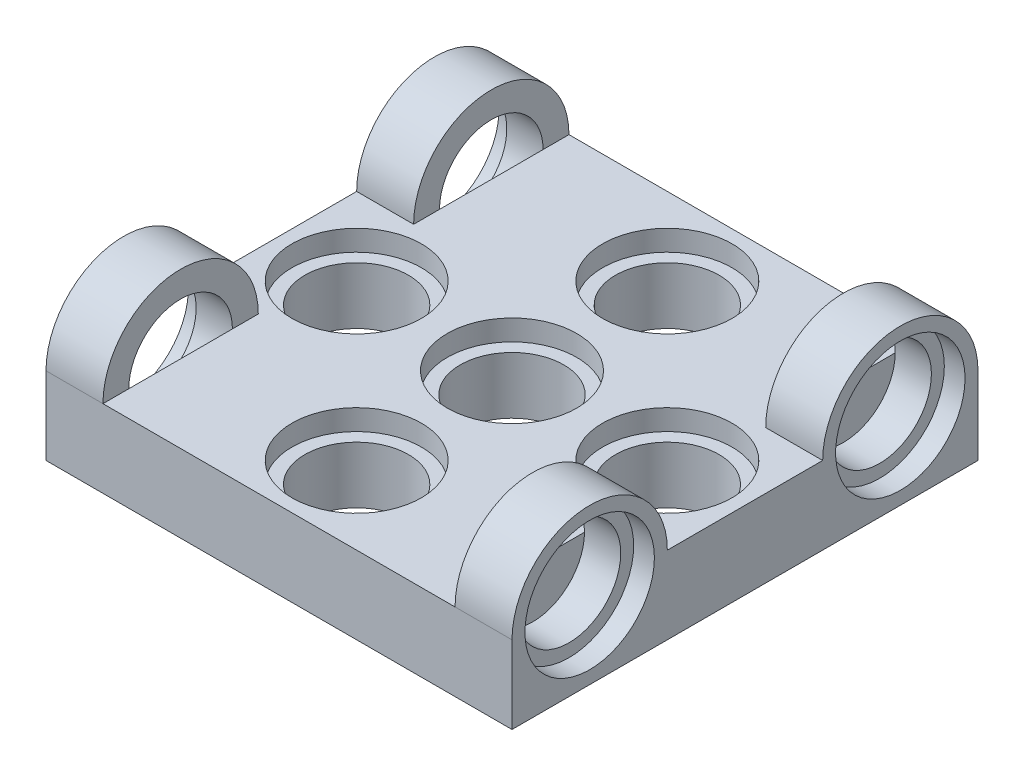
ISO-10303-21;
HEADER;
FILE_DESCRIPTION(('STEP AP214'),'2;1');
FILE_NAME('part.step','',(''),(''),'','','');
FILE_SCHEMA(('AUTOMOTIVE_DESIGN { 1 0 10303 214 1 1 1 1 }'));
ENDSEC;
DATA;
#1=APPLICATION_CONTEXT('core data for automotive mechanical design processes');
#2=APPLICATION_PROTOCOL_DEFINITION('international standard','automotive_design',2000,#1);
#3=PRODUCT_CONTEXT('',#1,'mechanical');
#4=PRODUCT('Part','Part','',(#3));
#5=PRODUCT_RELATED_PRODUCT_CATEGORY('part','',(#4));
#6=PRODUCT_DEFINITION_FORMATION('','',#4);
#7=PRODUCT_DEFINITION_CONTEXT('part definition',#1,'design');
#8=PRODUCT_DEFINITION('design','',#6,#7);
#9=PRODUCT_DEFINITION_SHAPE('','',#8);
#10=(LENGTH_UNIT() NAMED_UNIT(*) SI_UNIT(.MILLI.,.METRE.));
#11=(NAMED_UNIT(*) PLANE_ANGLE_UNIT() SI_UNIT($,.RADIAN.));
#12=(NAMED_UNIT(*) SI_UNIT($,.STERADIAN.) SOLID_ANGLE_UNIT());
#13=UNCERTAINTY_MEASURE_WITH_UNIT(LENGTH_MEASURE(1.E-05),#10,'distance_accuracy_value','');
#14=(GEOMETRIC_REPRESENTATION_CONTEXT(3) GLOBAL_UNCERTAINTY_ASSIGNED_CONTEXT((#13)) GLOBAL_UNIT_ASSIGNED_CONTEXT((#10,
#11,#12)) REPRESENTATION_CONTEXT('',''));
#15=CARTESIAN_POINT('',(0.,0.,0.));
#16=DIRECTION('',(0.,0.,1.));
#17=DIRECTION('',(1.,0.,0.));
#18=AXIS2_PLACEMENT_3D('',#15,#16,#17);
#19=CARTESIAN_POINT('',(18.,-3.,-4.5));
#20=DIRECTION('',(-1.,0.,0.));
#21=DIRECTION('',(0.,0.,1.));
#22=AXIS2_PLACEMENT_3D('',#19,#20,#21);
#23=PLANE('',#22);
#24=CARTESIAN_POINT('',(18.,0.,-1.5));
#25=DIRECTION('',(1.,0.,0.));
#26=DIRECTION('',(0.,0.,-1.));
#27=AXIS2_PLACEMENT_3D('',#24,#25,#26);
#28=CIRCLE('',#27,2.5);
#29=CARTESIAN_POINT('',(18.,0.,-4.));
#30=VERTEX_POINT('',#29);
#31=EDGE_CURVE('E136',#30,#30,#28,.T.);
#32=ORIENTED_EDGE('',*,*,#31,.F.);
#33=EDGE_LOOP('',(#32));
#34=FACE_BOUND('',#33,.T.);
#35=DIRECTION('',(0.,1.,0.));
#36=VECTOR('',#35,1.);
#37=CARTESIAN_POINT('',(18.,-3.,-4.5));
#38=LINE('',#37,#36);
#39=CARTESIAN_POINT('',(18.,-3.,-4.5));
#40=VERTEX_POINT('',#39);
#41=CARTESIAN_POINT('',(18.,0.,-4.5));
#42=VERTEX_POINT('',#41);
#43=EDGE_CURVE('E201',#40,#42,#38,.T.);
#44=ORIENTED_EDGE('',*,*,#43,.T.);
#45=CARTESIAN_POINT('',(18.,0.,-1.5));
#46=DIRECTION('',(1.,0.,0.));
#47=DIRECTION('',(0.,0.,-1.));
#48=AXIS2_PLACEMENT_3D('',#45,#46,#47);
#49=CIRCLE('',#48,3.);
#50=CARTESIAN_POINT('',(18.,0.,1.5));
#51=VERTEX_POINT('',#50);
#52=EDGE_CURVE('E153',#42,#51,#49,.T.);
#53=ORIENTED_EDGE('',*,*,#52,.T.);
#54=DIRECTION('',(0.,0.,1.));
#55=VECTOR('',#54,1.);
#56=CARTESIAN_POINT('',(18.,0.,-4.5));
#57=LINE('',#56,#55);
#58=CARTESIAN_POINT('',(18.,0.,7.5));
#59=VERTEX_POINT('',#58);
#60=EDGE_CURVE('E197',#51,#59,#57,.T.);
#61=ORIENTED_EDGE('',*,*,#60,.T.);
#62=CARTESIAN_POINT('',(18.,0.,10.5));
#63=DIRECTION('',(-1.,0.,0.));
#64=DIRECTION('',(0.,0.,1.));
#65=AXIS2_PLACEMENT_3D('',#62,#63,#64);
#66=CIRCLE('',#65,3.);
#67=CARTESIAN_POINT('',(18.,0.,13.5));
#68=VERTEX_POINT('',#67);
#69=EDGE_CURVE('E166',#68,#59,#66,.T.);
#70=ORIENTED_EDGE('',*,*,#69,.F.);
#71=DIRECTION('',(0.,1.,0.));
#72=VECTOR('',#71,1.);
#73=CARTESIAN_POINT('',(18.,-3.,13.5));
#74=LINE('',#73,#72);
#75=CARTESIAN_POINT('',(18.,-3.,13.5));
#76=VERTEX_POINT('',#75);
#77=EDGE_CURVE('E182',#76,#68,#74,.T.);
#78=ORIENTED_EDGE('',*,*,#77,.F.);
#79=DIRECTION('',(0.,0.,1.));
#80=VECTOR('',#79,1.);
#81=CARTESIAN_POINT('',(18.,-3.,-4.5));
#82=LINE('',#81,#80);
#83=EDGE_CURVE('E198',#40,#76,#82,.T.);
#84=ORIENTED_EDGE('',*,*,#83,.F.);
#85=EDGE_LOOP('',(#44,#53,#61,#70,#78,#84));
#86=FACE_BOUND('',#85,.T.);
#87=CARTESIAN_POINT('',(18.,0.,10.5));
#88=DIRECTION('',(1.,0.,0.));
#89=DIRECTION('',(0.,0.,-1.));
#90=AXIS2_PLACEMENT_3D('',#87,#88,#89);
#91=CIRCLE('',#90,2.5);
#92=CARTESIAN_POINT('',(18.,0.,8.));
#93=VERTEX_POINT('',#92);
#94=EDGE_CURVE('E163',#93,#93,#91,.T.);
#95=ORIENTED_EDGE('',*,*,#94,.F.);
#96=EDGE_LOOP('',(#95));
#97=FACE_BOUND('',#96,.T.);
#98=ADVANCED_FACE('F33',(#34,#86,#97),#23,.F.);
#99=CARTESIAN_POINT('',(0.,0.,0.));
#100=DIRECTION('',(0.,1.,0.));
#101=DIRECTION('',(0.,0.,1.));
#102=AXIS2_PLACEMENT_3D('',#99,#100,#101);
#103=PLANE('',#102);
#104=DIRECTION('',(1.,0.,0.));
#105=VECTOR('',#104,1.);
#106=CARTESIAN_POINT('',(15.8,0.,1.5));
#107=LINE('',#106,#105);
#108=CARTESIAN_POINT('',(15.8,0.,1.5));
#109=VERTEX_POINT('',#108);
#110=EDGE_CURVE('E54',#109,#51,#107,.T.);
#111=ORIENTED_EDGE('',*,*,#110,.F.);
#112=DIRECTION('',(0.,0.,-1.));
#113=VECTOR('',#112,1.);
#114=CARTESIAN_POINT('',(15.8,0.,-4.5));
#115=LINE('',#114,#113);
#116=CARTESIAN_POINT('',(15.8,0.,0.5));
#117=VERTEX_POINT('',#116);
#118=EDGE_CURVE('E148',#109,#117,#115,.T.);
#119=ORIENTED_EDGE('',*,*,#118,.T.);
#120=CARTESIAN_POINT('',(15.8,0.,-3.5));
#121=VERTEX_POINT('',#120);
#122=EDGE_CURVE('E134',#117,#121,#115,.T.);
#123=ORIENTED_EDGE('',*,*,#122,.T.);
#124=CARTESIAN_POINT('',(15.8,0.,-4.5));
#125=VERTEX_POINT('',#124);
#126=EDGE_CURVE('E143',#121,#125,#115,.T.);
#127=ORIENTED_EDGE('',*,*,#126,.T.);
#128=DIRECTION('',(-1.,0.,0.));
#129=VECTOR('',#128,1.);
#130=CARTESIAN_POINT('',(0.,0.,-4.5));
#131=LINE('',#130,#129);
#132=CARTESIAN_POINT('',(2.2,0.,-4.5));
#133=VERTEX_POINT('',#132);
#134=EDGE_CURVE('E325',#125,#133,#131,.T.);
#135=ORIENTED_EDGE('',*,*,#134,.T.);
#136=DIRECTION('',(0.,0.,-1.));
#137=VECTOR('',#136,1.);
#138=CARTESIAN_POINT('',(2.2,0.,-4.5));
#139=LINE('',#138,#137);
#140=CARTESIAN_POINT('',(2.2,0.,-3.5));
#141=VERTEX_POINT('',#140);
#142=EDGE_CURVE('E268',#141,#133,#139,.T.);
#143=ORIENTED_EDGE('',*,*,#142,.F.);
#144=CARTESIAN_POINT('',(2.2,0.,0.5));
#145=VERTEX_POINT('',#144);
#146=EDGE_CURVE('E273',#145,#141,#139,.T.);
#147=ORIENTED_EDGE('',*,*,#146,.F.);
#148=CARTESIAN_POINT('',(2.2,0.,1.5));
#149=VERTEX_POINT('',#148);
#150=EDGE_CURVE('E269',#149,#145,#139,.T.);
#151=ORIENTED_EDGE('',*,*,#150,.F.);
#152=DIRECTION('',(-1.,0.,0.));
#153=VECTOR('',#152,1.);
#154=CARTESIAN_POINT('',(2.2,0.,1.5));
#155=LINE('',#154,#153);
#156=CARTESIAN_POINT('',(0.,0.,1.5));
#157=VERTEX_POINT('',#156);
#158=EDGE_CURVE('E278',#149,#157,#155,.T.);
#159=ORIENTED_EDGE('',*,*,#158,.T.);
#160=DIRECTION('',(0.,0.,1.));
#161=VECTOR('',#160,1.);
#162=CARTESIAN_POINT('',(0.,0.,-4.5));
#163=LINE('',#162,#161);
#164=CARTESIAN_POINT('',(0.,0.,7.5));
#165=VERTEX_POINT('',#164);
#166=EDGE_CURVE('E316',#157,#165,#163,.T.);
#167=ORIENTED_EDGE('',*,*,#166,.T.);
#168=DIRECTION('',(-1.,0.,0.));
#169=VECTOR('',#168,1.);
#170=CARTESIAN_POINT('',(2.2,0.,7.5));
#171=LINE('',#170,#169);
#172=CARTESIAN_POINT('',(2.2,0.,7.5));
#173=VERTEX_POINT('',#172);
#174=EDGE_CURVE('E223',#173,#165,#171,.T.);
#175=ORIENTED_EDGE('',*,*,#174,.F.);
#176=DIRECTION('',(0.,0.,1.));
#177=VECTOR('',#176,1.);
#178=CARTESIAN_POINT('',(2.2,0.,13.5));
#179=LINE('',#178,#177);
#180=CARTESIAN_POINT('',(2.2,0.,8.5));
#181=VERTEX_POINT('',#180);
#182=EDGE_CURVE('E220',#173,#181,#179,.T.);
#183=ORIENTED_EDGE('',*,*,#182,.T.);
#184=CARTESIAN_POINT('',(2.2,0.,12.5));
#185=VERTEX_POINT('',#184);
#186=EDGE_CURVE('E224',#181,#185,#179,.T.);
#187=ORIENTED_EDGE('',*,*,#186,.T.);
#188=CARTESIAN_POINT('',(2.2,0.,13.5));
#189=VERTEX_POINT('',#188);
#190=EDGE_CURVE('E219',#185,#189,#179,.T.);
#191=ORIENTED_EDGE('',*,*,#190,.T.);
#192=DIRECTION('',(-1.,0.,0.));
#193=VECTOR('',#192,1.);
#194=CARTESIAN_POINT('',(0.,0.,13.5));
#195=LINE('',#194,#193);
#196=CARTESIAN_POINT('',(15.8,0.,13.5));
#197=VERTEX_POINT('',#196);
#198=EDGE_CURVE('E243',#197,#189,#195,.T.);
#199=ORIENTED_EDGE('',*,*,#198,.F.);
#200=DIRECTION('',(0.,0.,1.));
#201=VECTOR('',#200,1.);
#202=CARTESIAN_POINT('',(15.8,0.,13.5));
#203=LINE('',#202,#201);
#204=CARTESIAN_POINT('',(15.8,0.,12.5));
#205=VERTEX_POINT('',#204);
#206=EDGE_CURVE('E172',#205,#197,#203,.T.);
#207=ORIENTED_EDGE('',*,*,#206,.F.);
#208=CARTESIAN_POINT('',(15.8,0.,8.5));
#209=VERTEX_POINT('',#208);
#210=EDGE_CURVE('E177',#209,#205,#203,.T.);
#211=ORIENTED_EDGE('',*,*,#210,.F.);
#212=CARTESIAN_POINT('',(15.8,0.,7.5));
#213=VERTEX_POINT('',#212);
#214=EDGE_CURVE('E173',#213,#209,#203,.T.);
#215=ORIENTED_EDGE('',*,*,#214,.F.);
#216=DIRECTION('',(1.,0.,0.));
#217=VECTOR('',#216,1.);
#218=CARTESIAN_POINT('',(15.8,0.,7.5));
#219=LINE('',#218,#217);
#220=EDGE_CURVE('E176',#213,#59,#219,.T.);
#221=ORIENTED_EDGE('',*,*,#220,.T.);
#222=ORIENTED_EDGE('',*,*,#60,.F.);
#223=EDGE_LOOP('',(#111,#119,#123,#127,#135,#143,#147,#151,#159,#167,#175,#183,#187,#191,#199,
#207,#211,#215,#221,#222));
#224=FACE_BOUND('',#223,.T.);
#225=CARTESIAN_POINT('',(9.,0.,4.5));
#226=DIRECTION('',(0.,1.,0.));
#227=DIRECTION('',(0.,0.,1.));
#228=AXIS2_PLACEMENT_3D('',#225,#226,#227);
#229=CIRCLE('',#228,2.5);
#230=CARTESIAN_POINT('',(9.,0.,7.));
#231=VERTEX_POINT('',#230);
#232=EDGE_CURVE('E281',#231,#231,#229,.T.);
#233=ORIENTED_EDGE('',*,*,#232,.F.);
#234=EDGE_LOOP('',(#233));
#235=FACE_BOUND('',#234,.T.);
#236=CARTESIAN_POINT('',(9.,0.,10.5));
#237=DIRECTION('',(0.,1.,0.));
#238=DIRECTION('',(0.,0.,1.));
#239=AXIS2_PLACEMENT_3D('',#236,#237,#238);
#240=CIRCLE('',#239,2.5);
#241=CARTESIAN_POINT('',(9.,0.,13.));
#242=VERTEX_POINT('',#241);
#243=EDGE_CURVE('E231',#242,#242,#240,.T.);
#244=ORIENTED_EDGE('',*,*,#243,.F.);
#245=EDGE_LOOP('',(#244));
#246=FACE_BOUND('',#245,.T.);
#247=CARTESIAN_POINT('',(15.,0.,4.5));
#248=DIRECTION('',(0.,1.,0.));
#249=DIRECTION('',(0.,0.,1.));
#250=AXIS2_PLACEMENT_3D('',#247,#248,#249);
#251=CIRCLE('',#250,2.5);
#252=CARTESIAN_POINT('',(15.,0.,7.));
#253=VERTEX_POINT('',#252);
#254=EDGE_CURVE('E185',#253,#253,#251,.T.);
#255=ORIENTED_EDGE('',*,*,#254,.F.);
#256=EDGE_LOOP('',(#255));
#257=FACE_BOUND('',#256,.T.);
#258=CARTESIAN_POINT('',(9.,0.,-1.5));
#259=DIRECTION('',(0.,1.,0.));
#260=DIRECTION('',(0.,0.,1.));
#261=AXIS2_PLACEMENT_3D('',#258,#259,#260);
#262=CIRCLE('',#261,2.5);
#263=CARTESIAN_POINT('',(9.,0.,1.));
#264=VERTEX_POINT('',#263);
#265=EDGE_CURVE('E294',#264,#264,#262,.T.);
#266=ORIENTED_EDGE('',*,*,#265,.F.);
#267=EDGE_LOOP('',(#266));
#268=FACE_BOUND('',#267,.T.);
#269=CARTESIAN_POINT('',(3.,0.,4.5));
#270=DIRECTION('',(0.,1.,0.));
#271=DIRECTION('',(0.,0.,1.));
#272=AXIS2_PLACEMENT_3D('',#269,#270,#271);
#273=CIRCLE('',#272,2.5);
#274=CARTESIAN_POINT('',(3.,0.,7.));
#275=VERTEX_POINT('',#274);
#276=EDGE_CURVE('E304',#275,#275,#273,.T.);
#277=ORIENTED_EDGE('',*,*,#276,.F.);
#278=EDGE_LOOP('',(#277));
#279=FACE_BOUND('',#278,.T.);
#280=ADVANCED_FACE('F149',(#224,#235,#246,#257,#268,#279),#103,.T.);
#281=CARTESIAN_POINT('',(0.,-3.,-4.5));
#282=DIRECTION('',(-1.,0.,0.));
#283=DIRECTION('',(0.,0.,1.));
#284=AXIS2_PLACEMENT_3D('',#281,#282,#283);
#285=PLANE('',#284);
#286=CARTESIAN_POINT('',(0.,0.,10.5));
#287=DIRECTION('',(-1.,0.,0.));
#288=DIRECTION('',(0.,0.,1.));
#289=AXIS2_PLACEMENT_3D('',#286,#287,#288);
#290=CIRCLE('',#289,2.5);
#291=CARTESIAN_POINT('',(0.,0.,13.));
#292=VERTEX_POINT('',#291);
#293=EDGE_CURVE('E210',#292,#292,#290,.T.);
#294=ORIENTED_EDGE('',*,*,#293,.F.);
#295=EDGE_LOOP('',(#294));
#296=FACE_BOUND('',#295,.T.);
#297=CARTESIAN_POINT('',(0.,0.,-1.5));
#298=DIRECTION('',(-1.,0.,0.));
#299=DIRECTION('',(0.,0.,1.));
#300=AXIS2_PLACEMENT_3D('',#297,#298,#299);
#301=CIRCLE('',#300,2.5);
#302=CARTESIAN_POINT('',(0.,0.,1.));
#303=VERTEX_POINT('',#302);
#304=EDGE_CURVE('E258',#303,#303,#301,.T.);
#305=ORIENTED_EDGE('',*,*,#304,.F.);
#306=EDGE_LOOP('',(#305));
#307=FACE_BOUND('',#306,.T.);
#308=ORIENTED_EDGE('',*,*,#166,.F.);
#309=CARTESIAN_POINT('',(0.,0.,-1.5));
#310=DIRECTION('',(1.,0.,0.));
#311=DIRECTION('',(0.,0.,-1.));
#312=AXIS2_PLACEMENT_3D('',#309,#310,#311);
#313=CIRCLE('',#312,3.);
#314=CARTESIAN_POINT('',(0.,0.,-4.5));
#315=VERTEX_POINT('',#314);
#316=EDGE_CURVE('E261',#315,#157,#313,.T.);
#317=ORIENTED_EDGE('',*,*,#316,.F.);
#318=DIRECTION('',(0.,1.,0.));
#319=VECTOR('',#318,1.);
#320=CARTESIAN_POINT('',(0.,-3.,-4.5));
#321=LINE('',#320,#319);
#322=CARTESIAN_POINT('',(0.,-3.,-4.5));
#323=VERTEX_POINT('',#322);
#324=EDGE_CURVE('E298',#323,#315,#321,.T.);
#325=ORIENTED_EDGE('',*,*,#324,.F.);
#326=DIRECTION('',(0.,0.,1.));
#327=VECTOR('',#326,1.);
#328=CARTESIAN_POINT('',(0.,-3.,-4.5));
#329=LINE('',#328,#327);
#330=CARTESIAN_POINT('',(0.,-3.,13.5));
#331=VERTEX_POINT('',#330);
#332=EDGE_CURVE('E317',#323,#331,#329,.T.);
#333=ORIENTED_EDGE('',*,*,#332,.T.);
#334=DIRECTION('',(0.,1.,0.));
#335=VECTOR('',#334,1.);
#336=CARTESIAN_POINT('',(0.,-3.,13.5));
#337=LINE('',#336,#335);
#338=CARTESIAN_POINT('',(0.,0.,13.5));
#339=VERTEX_POINT('',#338);
#340=EDGE_CURVE('E247',#331,#339,#337,.T.);
#341=ORIENTED_EDGE('',*,*,#340,.T.);
#342=CARTESIAN_POINT('',(0.,0.,10.5));
#343=DIRECTION('',(-1.,0.,0.));
#344=DIRECTION('',(0.,0.,1.));
#345=AXIS2_PLACEMENT_3D('',#342,#343,#344);
#346=CIRCLE('',#345,3.);
#347=EDGE_CURVE('E213',#339,#165,#346,.T.);
#348=ORIENTED_EDGE('',*,*,#347,.T.);
#349=EDGE_LOOP('',(#308,#317,#325,#333,#341,#348));
#350=FACE_BOUND('',#349,.T.);
#351=ADVANCED_FACE('F35',(#296,#307,#350),#285,.T.);
#352=CARTESIAN_POINT('',(0.,-3.,-4.5));
#353=DIRECTION('',(0.,0.,-1.));
#354=DIRECTION('',(-1.,0.,0.));
#355=AXIS2_PLACEMENT_3D('',#352,#353,#354);
#356=PLANE('',#355);
#357=EDGE_CURVE('E320',#42,#125,#131,.T.);
#358=ORIENTED_EDGE('',*,*,#357,.F.);
#359=ORIENTED_EDGE('',*,*,#43,.F.);
#360=DIRECTION('',(-1.,0.,0.));
#361=VECTOR('',#360,1.);
#362=CARTESIAN_POINT('',(0.,-3.,-4.5));
#363=LINE('',#362,#361);
#364=EDGE_CURVE('E319',#40,#323,#363,.T.);
#365=ORIENTED_EDGE('',*,*,#364,.T.);
#366=ORIENTED_EDGE('',*,*,#324,.T.);
#367=DIRECTION('',(-1.,0.,0.));
#368=VECTOR('',#367,1.);
#369=CARTESIAN_POINT('',(2.2,0.,-4.5));
#370=LINE('',#369,#368);
#371=EDGE_CURVE('E272',#133,#315,#370,.T.);
#372=ORIENTED_EDGE('',*,*,#371,.F.);
#373=ORIENTED_EDGE('',*,*,#134,.F.);
#374=EDGE_LOOP('',(#358,#359,#365,#366,#372,#373));
#375=FACE_BOUND('',#374,.T.);
#376=ADVANCED_FACE('F362',(#375),#356,.T.);
#377=CARTESIAN_POINT('',(0.,-3.,0.));
#378=DIRECTION('',(0.,1.,0.));
#379=DIRECTION('',(0.,0.,1.));
#380=AXIS2_PLACEMENT_3D('',#377,#378,#379);
#381=PLANE('',#380);
#382=ORIENTED_EDGE('',*,*,#83,.T.);
#383=DIRECTION('',(-1.,0.,0.));
#384=VECTOR('',#383,1.);
#385=CARTESIAN_POINT('',(0.,-3.,13.5));
#386=LINE('',#385,#384);
#387=EDGE_CURVE('E244',#76,#331,#386,.T.);
#388=ORIENTED_EDGE('',*,*,#387,.T.);
#389=ORIENTED_EDGE('',*,*,#332,.F.);
#390=ORIENTED_EDGE('',*,*,#364,.F.);
#391=EDGE_LOOP('',(#382,#388,#389,#390));
#392=FACE_BOUND('',#391,.T.);
#393=CARTESIAN_POINT('',(9.,-3.,4.5));
#394=DIRECTION('',(0.,1.,0.));
#395=DIRECTION('',(0.,0.,1.));
#396=AXIS2_PLACEMENT_3D('',#393,#394,#395);
#397=CIRCLE('',#396,2.);
#398=CARTESIAN_POINT('',(9.,-3.,6.5));
#399=VERTEX_POINT('',#398);
#400=EDGE_CURVE('E290',#399,#399,#397,.T.);
#401=ORIENTED_EDGE('',*,*,#400,.T.);
#402=EDGE_LOOP('',(#401));
#403=FACE_BOUND('',#402,.T.);
#404=CARTESIAN_POINT('',(9.,-3.,10.5));
#405=DIRECTION('',(0.,1.,0.));
#406=DIRECTION('',(0.,0.,1.));
#407=AXIS2_PLACEMENT_3D('',#404,#405,#406);
#408=CIRCLE('',#407,2.);
#409=CARTESIAN_POINT('',(9.,-3.,12.5));
#410=VERTEX_POINT('',#409);
#411=EDGE_CURVE('E240',#410,#410,#408,.T.);
#412=ORIENTED_EDGE('',*,*,#411,.T.);
#413=EDGE_LOOP('',(#412));
#414=FACE_BOUND('',#413,.T.);
#415=CARTESIAN_POINT('',(9.,-3.,-1.5));
#416=DIRECTION('',(0.,1.,0.));
#417=DIRECTION('',(0.,0.,1.));
#418=AXIS2_PLACEMENT_3D('',#415,#416,#417);
#419=CIRCLE('',#418,2.00000000000001);
#420=CARTESIAN_POINT('',(9.,-3.,0.500000000000006));
#421=VERTEX_POINT('',#420);
#422=EDGE_CURVE('E297',#421,#421,#419,.T.);
#423=ORIENTED_EDGE('',*,*,#422,.T.);
#424=EDGE_LOOP('',(#423));
#425=FACE_BOUND('',#424,.T.);
#426=CARTESIAN_POINT('',(3.,-3.,4.5));
#427=DIRECTION('',(0.,1.,0.));
#428=DIRECTION('',(0.,0.,1.));
#429=AXIS2_PLACEMENT_3D('',#426,#427,#428);
#430=CIRCLE('',#429,2.);
#431=CARTESIAN_POINT('',(3.,-3.,6.5));
#432=VERTEX_POINT('',#431);
#433=EDGE_CURVE('E313',#432,#432,#430,.T.);
#434=ORIENTED_EDGE('',*,*,#433,.T.);
#435=EDGE_LOOP('',(#434));
#436=FACE_BOUND('',#435,.T.);
#437=CARTESIAN_POINT('',(15.,-3.,4.5));
#438=DIRECTION('',(0.,1.,0.));
#439=DIRECTION('',(0.,0.,1.));
#440=AXIS2_PLACEMENT_3D('',#437,#438,#439);
#441=CIRCLE('',#440,2.);
#442=CARTESIAN_POINT('',(15.,-3.,6.5));
#443=VERTEX_POINT('',#442);
#444=EDGE_CURVE('E194',#443,#443,#441,.T.);
#445=ORIENTED_EDGE('',*,*,#444,.T.);
#446=EDGE_LOOP('',(#445));
#447=FACE_BOUND('',#446,.T.);
#448=ADVANCED_FACE('F499',(#392,#403,#414,#425,#436,#447),#381,.F.);
#449=CARTESIAN_POINT('',(3.,0.,4.5));
#450=DIRECTION('',(0.,1.,0.));
#451=DIRECTION('',(0.,0.,1.));
#452=AXIS2_PLACEMENT_3D('',#449,#450,#451);
#453=CYLINDRICAL_SURFACE('',#452,2.00000000000001);
#454=CARTESIAN_POINT('',(3.,-0.799999999999995,4.5));
#455=DIRECTION('',(0.,1.,0.));
#456=DIRECTION('',(0.,0.,1.));
#457=AXIS2_PLACEMENT_3D('',#454,#455,#456);
#458=CIRCLE('',#457,2.00000000000001);
#459=CARTESIAN_POINT('',(3.,-0.799999999999995,6.50000000000001));
#460=VERTEX_POINT('',#459);
#461=EDGE_CURVE('E310',#460,#460,#458,.T.);
#462=ORIENTED_EDGE('',*,*,#461,.T.);
#463=EDGE_LOOP('',(#462));
#464=FACE_BOUND('',#463,.T.);
#465=ORIENTED_EDGE('',*,*,#433,.F.);
#466=EDGE_LOOP('',(#465));
#467=FACE_BOUND('',#466,.T.);
#468=ADVANCED_FACE('F495',(#464,#467),#453,.F.);
#469=CARTESIAN_POINT('',(5.00000000000001,-0.799999999999997,4.5));
#470=DIRECTION('',(0.,-1.,0.));
#471=DIRECTION('',(0.,0.,-1.));
#472=AXIS2_PLACEMENT_3D('',#469,#470,#471);
#473=PLANE('',#472);
#474=ORIENTED_EDGE('',*,*,#461,.F.);
#475=EDGE_LOOP('',(#474));
#476=FACE_BOUND('',#475,.T.);
#477=CARTESIAN_POINT('',(3.,-0.799999999999999,4.5));
#478=DIRECTION('',(0.,1.,0.));
#479=DIRECTION('',(0.,0.,1.));
#480=AXIS2_PLACEMENT_3D('',#477,#478,#479);
#481=CIRCLE('',#480,2.5);
#482=CARTESIAN_POINT('',(3.,-0.799999999999999,7.));
#483=VERTEX_POINT('',#482);
#484=EDGE_CURVE('E307',#483,#483,#481,.T.);
#485=ORIENTED_EDGE('',*,*,#484,.T.);
#486=EDGE_LOOP('',(#485));
#487=FACE_BOUND('',#486,.T.);
#488=ADVANCED_FACE('F491',(#476,#487),#473,.F.);
#489=CARTESIAN_POINT('',(3.,0.,4.5));
#490=DIRECTION('',(0.,1.,0.));
#491=DIRECTION('',(0.,0.,1.));
#492=AXIS2_PLACEMENT_3D('',#489,#490,#491);
#493=CYLINDRICAL_SURFACE('',#492,2.5);
#494=ORIENTED_EDGE('',*,*,#276,.T.);
#495=EDGE_LOOP('',(#494));
#496=FACE_BOUND('',#495,.T.);
#497=ORIENTED_EDGE('',*,*,#484,.F.);
#498=EDGE_LOOP('',(#497));
#499=FACE_BOUND('',#498,.T.);
#500=ADVANCED_FACE('F487',(#496,#499),#493,.F.);
#501=CARTESIAN_POINT('',(9.,0.,-1.5));
#502=DIRECTION('',(0.,1.,0.));
#503=DIRECTION('',(0.,0.,1.));
#504=AXIS2_PLACEMENT_3D('',#501,#502,#503);
#505=CYLINDRICAL_SURFACE('',#504,2.00000000000001);
#506=CARTESIAN_POINT('',(9.,-0.799999999999995,-1.5));
#507=DIRECTION('',(0.,1.,0.));
#508=DIRECTION('',(0.,0.,1.));
#509=AXIS2_PLACEMENT_3D('',#506,#507,#508);
#510=CIRCLE('',#509,2.00000000000001);
#511=CARTESIAN_POINT('',(9.,-0.799999999999995,0.500000000000012));
#512=VERTEX_POINT('',#511);
#513=EDGE_CURVE('E301',#512,#512,#510,.T.);
#514=ORIENTED_EDGE('',*,*,#513,.T.);
#515=EDGE_LOOP('',(#514));
#516=FACE_BOUND('',#515,.T.);
#517=ORIENTED_EDGE('',*,*,#422,.F.);
#518=EDGE_LOOP('',(#517));
#519=FACE_BOUND('',#518,.T.);
#520=ADVANCED_FACE('F483',(#516,#519),#505,.F.);
#521=CARTESIAN_POINT('',(11.,-0.799999999999997,-1.5));
#522=DIRECTION('',(0.,-1.,0.));
#523=DIRECTION('',(0.,0.,-1.));
#524=AXIS2_PLACEMENT_3D('',#521,#522,#523);
#525=PLANE('',#524);
#526=ORIENTED_EDGE('',*,*,#513,.F.);
#527=EDGE_LOOP('',(#526));
#528=FACE_BOUND('',#527,.T.);
#529=CARTESIAN_POINT('',(9.,-0.799999999999999,-1.5));
#530=DIRECTION('',(0.,1.,0.));
#531=DIRECTION('',(0.,0.,1.));
#532=AXIS2_PLACEMENT_3D('',#529,#530,#531);
#533=CIRCLE('',#532,2.5);
#534=CARTESIAN_POINT('',(9.,-0.799999999999999,1.));
#535=VERTEX_POINT('',#534);
#536=EDGE_CURVE('E293',#535,#535,#533,.T.);
#537=ORIENTED_EDGE('',*,*,#536,.T.);
#538=EDGE_LOOP('',(#537));
#539=FACE_BOUND('',#538,.T.);
#540=ADVANCED_FACE('F479',(#528,#539),#525,.F.);
#541=CARTESIAN_POINT('',(9.,0.,-1.5));
#542=DIRECTION('',(0.,1.,0.));
#543=DIRECTION('',(0.,0.,1.));
#544=AXIS2_PLACEMENT_3D('',#541,#542,#543);
#545=CYLINDRICAL_SURFACE('',#544,2.5);
#546=ORIENTED_EDGE('',*,*,#265,.T.);
#547=EDGE_LOOP('',(#546));
#548=FACE_BOUND('',#547,.T.);
#549=ORIENTED_EDGE('',*,*,#536,.F.);
#550=EDGE_LOOP('',(#549));
#551=FACE_BOUND('',#550,.T.);
#552=ADVANCED_FACE('F475',(#548,#551),#545,.F.);
#553=CARTESIAN_POINT('',(9.,0.,4.5));
#554=DIRECTION('',(0.,1.,0.));
#555=DIRECTION('',(0.,0.,1.));
#556=AXIS2_PLACEMENT_3D('',#553,#554,#555);
#557=CYLINDRICAL_SURFACE('',#556,2.00000000000001);
#558=CARTESIAN_POINT('',(9.,-0.799999999999995,4.5));
#559=DIRECTION('',(0.,1.,0.));
#560=DIRECTION('',(0.,0.,1.));
#561=AXIS2_PLACEMENT_3D('',#558,#559,#560);
#562=CIRCLE('',#561,2.00000000000001);
#563=CARTESIAN_POINT('',(9.,-0.799999999999995,6.50000000000001));
#564=VERTEX_POINT('',#563);
#565=EDGE_CURVE('E287',#564,#564,#562,.T.);
#566=ORIENTED_EDGE('',*,*,#565,.T.);
#567=EDGE_LOOP('',(#566));
#568=FACE_BOUND('',#567,.T.);
#569=ORIENTED_EDGE('',*,*,#400,.F.);
#570=EDGE_LOOP('',(#569));
#571=FACE_BOUND('',#570,.T.);
#572=ADVANCED_FACE('F471',(#568,#571),#557,.F.);
#573=CARTESIAN_POINT('',(11.,-0.799999999999997,4.5));
#574=DIRECTION('',(0.,-1.,0.));
#575=DIRECTION('',(0.,0.,-1.));
#576=AXIS2_PLACEMENT_3D('',#573,#574,#575);
#577=PLANE('',#576);
#578=CARTESIAN_POINT('',(9.,-0.799999999999999,4.5));
#579=DIRECTION('',(0.,1.,0.));
#580=DIRECTION('',(0.,0.,1.));
#581=AXIS2_PLACEMENT_3D('',#578,#579,#580);
#582=CIRCLE('',#581,2.5);
#583=CARTESIAN_POINT('',(9.,-0.799999999999999,7.));
#584=VERTEX_POINT('',#583);
#585=EDGE_CURVE('E284',#584,#584,#582,.T.);
#586=ORIENTED_EDGE('',*,*,#585,.T.);
#587=EDGE_LOOP('',(#586));
#588=FACE_BOUND('',#587,.T.);
#589=ORIENTED_EDGE('',*,*,#565,.F.);
#590=EDGE_LOOP('',(#589));
#591=FACE_BOUND('',#590,.T.);
#592=ADVANCED_FACE('F467',(#588,#591),#577,.F.);
#593=CARTESIAN_POINT('',(9.,0.,4.5));
#594=DIRECTION('',(0.,1.,0.));
#595=DIRECTION('',(0.,0.,1.));
#596=AXIS2_PLACEMENT_3D('',#593,#594,#595);
#597=CYLINDRICAL_SURFACE('',#596,2.5);
#598=ORIENTED_EDGE('',*,*,#585,.F.);
#599=EDGE_LOOP('',(#598));
#600=FACE_BOUND('',#599,.T.);
#601=ORIENTED_EDGE('',*,*,#232,.T.);
#602=EDGE_LOOP('',(#601));
#603=FACE_BOUND('',#602,.T.);
#604=ADVANCED_FACE('F464',(#600,#603),#597,.F.);
#605=CARTESIAN_POINT('',(2.2,0.,-1.5));
#606=DIRECTION('',(-1.,0.,0.));
#607=DIRECTION('',(0.,0.,1.));
#608=AXIS2_PLACEMENT_3D('',#605,#606,#607);
#609=CYLINDRICAL_SURFACE('',#608,3.);
#610=ORIENTED_EDGE('',*,*,#316,.T.);
#611=ORIENTED_EDGE('',*,*,#158,.F.);
#612=CARTESIAN_POINT('',(2.2,0.,-1.5));
#613=DIRECTION('',(1.,0.,0.));
#614=DIRECTION('',(0.,0.,-1.));
#615=AXIS2_PLACEMENT_3D('',#612,#613,#614);
#616=CIRCLE('',#615,3.);
#617=EDGE_CURVE('E265',#133,#149,#616,.T.);
#618=ORIENTED_EDGE('',*,*,#617,.F.);
#619=ORIENTED_EDGE('',*,*,#371,.T.);
#620=EDGE_LOOP('',(#610,#611,#618,#619));
#621=FACE_BOUND('',#620,.T.);
#622=ADVANCED_FACE('F378',(#621),#609,.T.);
#623=CARTESIAN_POINT('',(2.2,0.,-1.5));
#624=DIRECTION('',(1.,0.,0.));
#625=DIRECTION('',(0.,0.,-1.));
#626=AXIS2_PLACEMENT_3D('',#623,#624,#625);
#627=PLANE('',#626);
#628=CARTESIAN_POINT('',(2.2,0.,-1.5));
#629=DIRECTION('',(1.,0.,0.));
#630=DIRECTION('',(0.,0.,-1.));
#631=AXIS2_PLACEMENT_3D('',#628,#629,#630);
#632=CIRCLE('',#631,2.);
#633=EDGE_CURVE('E331',#141,#145,#632,.T.);
#634=ORIENTED_EDGE('',*,*,#633,.F.);
#635=ORIENTED_EDGE('',*,*,#142,.T.);
#636=ORIENTED_EDGE('',*,*,#617,.T.);
#637=ORIENTED_EDGE('',*,*,#150,.T.);
#638=EDGE_LOOP('',(#634,#635,#636,#637));
#639=FACE_BOUND('',#638,.T.);
#640=ADVANCED_FACE('F370',(#639),#627,.T.);
#641=CARTESIAN_POINT('',(0.,0.,-1.5));
#642=DIRECTION('',(-1.,0.,0.));
#643=DIRECTION('',(0.,0.,1.));
#644=AXIS2_PLACEMENT_3D('',#641,#642,#643);
#645=CYLINDRICAL_SURFACE('',#644,2.);
#646=CARTESIAN_POINT('',(0.799999999999988,0.,-1.5));
#647=DIRECTION('',(-1.,0.,0.));
#648=DIRECTION('',(0.,0.,1.));
#649=AXIS2_PLACEMENT_3D('',#646,#647,#648);
#650=CIRCLE('',#649,2.);
#651=CARTESIAN_POINT('',(0.799999999999988,0.,0.5));
#652=VERTEX_POINT('',#651);
#653=EDGE_CURVE('E254',#652,#652,#650,.T.);
#654=ORIENTED_EDGE('',*,*,#653,.T.);
#655=EDGE_LOOP('',(#654));
#656=FACE_BOUND('',#655,.T.);
#657=ORIENTED_EDGE('',*,*,#633,.T.);
#658=CARTESIAN_POINT('',(2.2,0.,-1.5));
#659=DIRECTION('',(1.,0.,0.));
#660=DIRECTION('',(0.,0.,-1.));
#661=AXIS2_PLACEMENT_3D('',#658,#659,#660);
#662=CIRCLE('',#661,2.);
#663=EDGE_CURVE('E253',#141,#145,#662,.F.);
#664=ORIENTED_EDGE('',*,*,#663,.F.);
#665=EDGE_LOOP('',(#657,#664));
#666=FACE_BOUND('',#665,.T.);
#667=ADVANCED_FACE('F451',(#656,#666),#645,.F.);
#668=CARTESIAN_POINT('',(0.799999999999993,2.,-1.5));
#669=DIRECTION('',(1.,0.,0.));
#670=DIRECTION('',(0.,0.,-1.));
#671=AXIS2_PLACEMENT_3D('',#668,#669,#670);
#672=PLANE('',#671);
#673=ORIENTED_EDGE('',*,*,#653,.F.);
#674=EDGE_LOOP('',(#673));
#675=FACE_BOUND('',#674,.T.);
#676=CARTESIAN_POINT('',(0.799999999999999,0.,-1.5));
#677=DIRECTION('',(-1.,0.,0.));
#678=DIRECTION('',(0.,0.,1.));
#679=AXIS2_PLACEMENT_3D('',#676,#677,#678);
#680=CIRCLE('',#679,2.5);
#681=CARTESIAN_POINT('',(0.799999999999999,0.,1.));
#682=VERTEX_POINT('',#681);
#683=EDGE_CURVE('E257',#682,#682,#680,.T.);
#684=ORIENTED_EDGE('',*,*,#683,.T.);
#685=EDGE_LOOP('',(#684));
#686=FACE_BOUND('',#685,.T.);
#687=ADVANCED_FACE('F444',(#675,#686),#672,.F.);
#688=CARTESIAN_POINT('',(0.,0.,-1.5));
#689=DIRECTION('',(-1.,0.,0.));
#690=DIRECTION('',(0.,0.,1.));
#691=AXIS2_PLACEMENT_3D('',#688,#689,#690);
#692=CYLINDRICAL_SURFACE('',#691,2.5);
#693=ORIENTED_EDGE('',*,*,#683,.F.);
#694=EDGE_LOOP('',(#693));
#695=FACE_BOUND('',#694,.T.);
#696=ORIENTED_EDGE('',*,*,#304,.T.);
#697=EDGE_LOOP('',(#696));
#698=FACE_BOUND('',#697,.T.);
#699=ADVANCED_FACE('F442',(#695,#698),#692,.F.);
#700=CARTESIAN_POINT('',(2.2,0.,-1.5));
#701=DIRECTION('',(1.,0.,0.));
#702=DIRECTION('',(0.,0.,-1.));
#703=AXIS2_PLACEMENT_3D('',#700,#701,#702);
#704=PLANE('',#703);
#705=ORIENTED_EDGE('',*,*,#146,.T.);
#706=ORIENTED_EDGE('',*,*,#663,.T.);
#707=EDGE_LOOP('',(#705,#706));
#708=FACE_BOUND('',#707,.T.);
#709=ADVANCED_FACE('F374',(#708),#704,.F.);
#710=CARTESIAN_POINT('',(0.,-3.,13.5));
#711=DIRECTION('',(0.,0.,-1.));
#712=DIRECTION('',(-1.,0.,0.));
#713=AXIS2_PLACEMENT_3D('',#710,#711,#712);
#714=PLANE('',#713);
#715=EDGE_CURVE('E248',#68,#197,#195,.T.);
#716=ORIENTED_EDGE('',*,*,#715,.T.);
#717=ORIENTED_EDGE('',*,*,#198,.T.);
#718=DIRECTION('',(-1.,0.,0.));
#719=VECTOR('',#718,1.);
#720=CARTESIAN_POINT('',(2.2,0.,13.5));
#721=LINE('',#720,#719);
#722=EDGE_CURVE('E228',#189,#339,#721,.T.);
#723=ORIENTED_EDGE('',*,*,#722,.T.);
#724=ORIENTED_EDGE('',*,*,#340,.F.);
#725=ORIENTED_EDGE('',*,*,#387,.F.);
#726=ORIENTED_EDGE('',*,*,#77,.T.);
#727=EDGE_LOOP('',(#716,#717,#723,#724,#725,#726));
#728=FACE_BOUND('',#727,.T.);
#729=ADVANCED_FACE('F387',(#728),#714,.F.);
#730=CARTESIAN_POINT('',(11.,-0.799999999999997,10.5));
#731=DIRECTION('',(0.,-1.,0.));
#732=DIRECTION('',(0.,0.,-1.));
#733=AXIS2_PLACEMENT_3D('',#730,#731,#732);
#734=PLANE('',#733);
#735=CARTESIAN_POINT('',(9.,-0.799999999999999,10.5));
#736=DIRECTION('',(0.,1.,0.));
#737=DIRECTION('',(0.,0.,1.));
#738=AXIS2_PLACEMENT_3D('',#735,#736,#737);
#739=CIRCLE('',#738,2.5);
#740=CARTESIAN_POINT('',(9.,-0.799999999999999,13.));
#741=VERTEX_POINT('',#740);
#742=EDGE_CURVE('E234',#741,#741,#739,.T.);
#743=ORIENTED_EDGE('',*,*,#742,.T.);
#744=EDGE_LOOP('',(#743));
#745=FACE_BOUND('',#744,.T.);
#746=CARTESIAN_POINT('',(9.,-0.799999999999995,10.5));
#747=DIRECTION('',(0.,1.,0.));
#748=DIRECTION('',(0.,0.,1.));
#749=AXIS2_PLACEMENT_3D('',#746,#747,#748);
#750=CIRCLE('',#749,2.00000000000001);
#751=CARTESIAN_POINT('',(9.,-0.799999999999995,12.5));
#752=VERTEX_POINT('',#751);
#753=EDGE_CURVE('E237',#752,#752,#750,.T.);
#754=ORIENTED_EDGE('',*,*,#753,.F.);
#755=EDGE_LOOP('',(#754));
#756=FACE_BOUND('',#755,.T.);
#757=ADVANCED_FACE('F556',(#745,#756),#734,.F.);
#758=CARTESIAN_POINT('',(9.,0.,10.5));
#759=DIRECTION('',(0.,1.,0.));
#760=DIRECTION('',(0.,0.,1.));
#761=AXIS2_PLACEMENT_3D('',#758,#759,#760);
#762=CYLINDRICAL_SURFACE('',#761,2.00000000000001);
#763=ORIENTED_EDGE('',*,*,#753,.T.);
#764=EDGE_LOOP('',(#763));
#765=FACE_BOUND('',#764,.T.);
#766=ORIENTED_EDGE('',*,*,#411,.F.);
#767=EDGE_LOOP('',(#766));
#768=FACE_BOUND('',#767,.T.);
#769=ADVANCED_FACE('F562',(#765,#768),#762,.F.);
#770=CARTESIAN_POINT('',(9.,0.,10.5));
#771=DIRECTION('',(0.,1.,0.));
#772=DIRECTION('',(0.,0.,1.));
#773=AXIS2_PLACEMENT_3D('',#770,#771,#772);
#774=CYLINDRICAL_SURFACE('',#773,2.5);
#775=ORIENTED_EDGE('',*,*,#742,.F.);
#776=EDGE_LOOP('',(#775));
#777=FACE_BOUND('',#776,.T.);
#778=ORIENTED_EDGE('',*,*,#243,.T.);
#779=EDGE_LOOP('',(#778));
#780=FACE_BOUND('',#779,.T.);
#781=ADVANCED_FACE('F570',(#777,#780),#774,.F.);
#782=CARTESIAN_POINT('',(2.2,0.,10.5));
#783=DIRECTION('',(-1.,0.,0.));
#784=DIRECTION('',(0.,0.,1.));
#785=AXIS2_PLACEMENT_3D('',#782,#783,#784);
#786=CYLINDRICAL_SURFACE('',#785,3.);
#787=ORIENTED_EDGE('',*,*,#347,.F.);
#788=ORIENTED_EDGE('',*,*,#722,.F.);
#789=CARTESIAN_POINT('',(2.2,0.,10.5));
#790=DIRECTION('',(-1.,0.,0.));
#791=DIRECTION('',(0.,0.,1.));
#792=AXIS2_PLACEMENT_3D('',#789,#790,#791);
#793=CIRCLE('',#792,3.);
#794=EDGE_CURVE('E217',#189,#173,#793,.T.);
#795=ORIENTED_EDGE('',*,*,#794,.T.);
#796=ORIENTED_EDGE('',*,*,#174,.T.);
#797=EDGE_LOOP('',(#787,#788,#795,#796));
#798=FACE_BOUND('',#797,.T.);
#799=ADVANCED_FACE('F384',(#798),#786,.T.);
#800=CARTESIAN_POINT('',(2.2,0.,10.5));
#801=DIRECTION('',(1.,0.,0.));
#802=DIRECTION('',(0.,0.,1.));
#803=AXIS2_PLACEMENT_3D('',#800,#801,#802);
#804=PLANE('',#803);
#805=CARTESIAN_POINT('',(2.2,0.,10.5));
#806=DIRECTION('',(1.,0.,0.));
#807=DIRECTION('',(0.,0.,-1.));
#808=AXIS2_PLACEMENT_3D('',#805,#806,#807);
#809=CIRCLE('',#808,2.);
#810=EDGE_CURVE('E334',#181,#185,#809,.T.);
#811=ORIENTED_EDGE('',*,*,#810,.F.);
#812=ORIENTED_EDGE('',*,*,#182,.F.);
#813=ORIENTED_EDGE('',*,*,#794,.F.);
#814=ORIENTED_EDGE('',*,*,#190,.F.);
#815=EDGE_LOOP('',(#811,#812,#813,#814));
#816=FACE_BOUND('',#815,.T.);
#817=ADVANCED_FACE('F394',(#816),#804,.T.);
#818=CARTESIAN_POINT('',(2.2,0.,10.5));
#819=DIRECTION('',(1.,0.,0.));
#820=DIRECTION('',(0.,0.,1.));
#821=AXIS2_PLACEMENT_3D('',#818,#819,#820);
#822=PLANE('',#821);
#823=CARTESIAN_POINT('',(2.2,0.,10.5));
#824=DIRECTION('',(1.,0.,0.));
#825=DIRECTION('',(0.,0.,-1.));
#826=AXIS2_PLACEMENT_3D('',#823,#824,#825);
#827=CIRCLE('',#826,2.);
#828=EDGE_CURVE('E205',#181,#185,#827,.F.);
#829=ORIENTED_EDGE('',*,*,#828,.T.);
#830=ORIENTED_EDGE('',*,*,#186,.F.);
#831=EDGE_LOOP('',(#829,#830));
#832=FACE_BOUND('',#831,.T.);
#833=ADVANCED_FACE('F399',(#832),#822,.F.);
#834=CARTESIAN_POINT('',(0.,0.,10.5));
#835=DIRECTION('',(-1.,0.,0.));
#836=DIRECTION('',(0.,0.,1.));
#837=AXIS2_PLACEMENT_3D('',#834,#835,#836);
#838=CYLINDRICAL_SURFACE('',#837,2.);
#839=CARTESIAN_POINT('',(0.799999999999988,0.,10.5));
#840=DIRECTION('',(-1.,0.,0.));
#841=DIRECTION('',(0.,0.,1.));
#842=AXIS2_PLACEMENT_3D('',#839,#840,#841);
#843=CIRCLE('',#842,2.);
#844=CARTESIAN_POINT('',(0.799999999999988,0.,12.5));
#845=VERTEX_POINT('',#844);
#846=EDGE_CURVE('E206',#845,#845,#843,.T.);
#847=ORIENTED_EDGE('',*,*,#846,.T.);
#848=EDGE_LOOP('',(#847));
#849=FACE_BOUND('',#848,.T.);
#850=ORIENTED_EDGE('',*,*,#810,.T.);
#851=ORIENTED_EDGE('',*,*,#828,.F.);
#852=EDGE_LOOP('',(#850,#851));
#853=FACE_BOUND('',#852,.T.);
#854=ADVANCED_FACE('F397',(#849,#853),#838,.F.);
#855=CARTESIAN_POINT('',(0.799999999999993,2.,10.5));
#856=DIRECTION('',(1.,0.,0.));
#857=DIRECTION('',(0.,0.,-1.));
#858=AXIS2_PLACEMENT_3D('',#855,#856,#857);
#859=PLANE('',#858);
#860=ORIENTED_EDGE('',*,*,#846,.F.);
#861=EDGE_LOOP('',(#860));
#862=FACE_BOUND('',#861,.T.);
#863=CARTESIAN_POINT('',(0.799999999999999,0.,10.5));
#864=DIRECTION('',(-1.,0.,0.));
#865=DIRECTION('',(0.,0.,1.));
#866=AXIS2_PLACEMENT_3D('',#863,#864,#865);
#867=CIRCLE('',#866,2.5);
#868=CARTESIAN_POINT('',(0.799999999999999,0.,13.));
#869=VERTEX_POINT('',#868);
#870=EDGE_CURVE('E209',#869,#869,#867,.T.);
#871=ORIENTED_EDGE('',*,*,#870,.T.);
#872=EDGE_LOOP('',(#871));
#873=FACE_BOUND('',#872,.T.);
#874=ADVANCED_FACE('F406',(#862,#873),#859,.F.);
#875=CARTESIAN_POINT('',(0.,0.,10.5));
#876=DIRECTION('',(-1.,0.,0.));
#877=DIRECTION('',(0.,0.,1.));
#878=AXIS2_PLACEMENT_3D('',#875,#876,#877);
#879=CYLINDRICAL_SURFACE('',#878,2.5);
#880=ORIENTED_EDGE('',*,*,#870,.F.);
#881=EDGE_LOOP('',(#880));
#882=FACE_BOUND('',#881,.T.);
#883=ORIENTED_EDGE('',*,*,#293,.T.);
#884=EDGE_LOOP('',(#883));
#885=FACE_BOUND('',#884,.T.);
#886=ADVANCED_FACE('F425',(#882,#885),#879,.F.);
#887=CARTESIAN_POINT('',(17.,-0.799999999999997,4.5));
#888=DIRECTION('',(0.,-1.,0.));
#889=DIRECTION('',(0.,0.,-1.));
#890=AXIS2_PLACEMENT_3D('',#887,#888,#889);
#891=PLANE('',#890);
#892=CARTESIAN_POINT('',(15.,-0.799999999999999,4.5));
#893=DIRECTION('',(0.,1.,0.));
#894=DIRECTION('',(0.,0.,1.));
#895=AXIS2_PLACEMENT_3D('',#892,#893,#894);
#896=CIRCLE('',#895,2.5);
#897=CARTESIAN_POINT('',(15.,-0.799999999999999,7.));
#898=VERTEX_POINT('',#897);
#899=EDGE_CURVE('E188',#898,#898,#896,.T.);
#900=ORIENTED_EDGE('',*,*,#899,.T.);
#901=EDGE_LOOP('',(#900));
#902=FACE_BOUND('',#901,.T.);
#903=CARTESIAN_POINT('',(15.,-0.799999999999995,4.5));
#904=DIRECTION('',(0.,1.,0.));
#905=DIRECTION('',(0.,0.,1.));
#906=AXIS2_PLACEMENT_3D('',#903,#904,#905);
#907=CIRCLE('',#906,2.00000000000001);
#908=CARTESIAN_POINT('',(15.,-0.799999999999995,6.50000000000001));
#909=VERTEX_POINT('',#908);
#910=EDGE_CURVE('E191',#909,#909,#907,.T.);
#911=ORIENTED_EDGE('',*,*,#910,.F.);
#912=EDGE_LOOP('',(#911));
#913=FACE_BOUND('',#912,.T.);
#914=ADVANCED_FACE('F428',(#902,#913),#891,.F.);
#915=CARTESIAN_POINT('',(15.,0.,4.5));
#916=DIRECTION('',(0.,1.,0.));
#917=DIRECTION('',(0.,0.,1.));
#918=AXIS2_PLACEMENT_3D('',#915,#916,#917);
#919=CYLINDRICAL_SURFACE('',#918,2.00000000000001);
#920=ORIENTED_EDGE('',*,*,#444,.F.);
#921=EDGE_LOOP('',(#920));
#922=FACE_BOUND('',#921,.T.);
#923=ORIENTED_EDGE('',*,*,#910,.T.);
#924=EDGE_LOOP('',(#923));
#925=FACE_BOUND('',#924,.T.);
#926=ADVANCED_FACE('F421',(#922,#925),#919,.F.);
#927=CARTESIAN_POINT('',(15.,0.,4.5));
#928=DIRECTION('',(0.,1.,0.));
#929=DIRECTION('',(0.,0.,1.));
#930=AXIS2_PLACEMENT_3D('',#927,#928,#929);
#931=CYLINDRICAL_SURFACE('',#930,2.5);
#932=ORIENTED_EDGE('',*,*,#254,.T.);
#933=EDGE_LOOP('',(#932));
#934=FACE_BOUND('',#933,.T.);
#935=ORIENTED_EDGE('',*,*,#899,.F.);
#936=EDGE_LOOP('',(#935));
#937=FACE_BOUND('',#936,.T.);
#938=ADVANCED_FACE('F634',(#934,#937),#931,.F.);
#939=CARTESIAN_POINT('',(15.8,0.,10.5));
#940=DIRECTION('',(1.,0.,0.));
#941=DIRECTION('',(0.,0.,-1.));
#942=AXIS2_PLACEMENT_3D('',#939,#940,#941);
#943=CYLINDRICAL_SURFACE('',#942,3.);
#944=ORIENTED_EDGE('',*,*,#69,.T.);
#945=ORIENTED_EDGE('',*,*,#220,.F.);
#946=CARTESIAN_POINT('',(15.8,0.,10.5));
#947=DIRECTION('',(-1.,0.,0.));
#948=DIRECTION('',(0.,0.,1.));
#949=AXIS2_PLACEMENT_3D('',#946,#947,#948);
#950=CIRCLE('',#949,3.);
#951=EDGE_CURVE('E170',#197,#213,#950,.T.);
#952=ORIENTED_EDGE('',*,*,#951,.F.);
#953=ORIENTED_EDGE('',*,*,#715,.F.);
#954=EDGE_LOOP('',(#944,#945,#952,#953));
#955=FACE_BOUND('',#954,.T.);
#956=ADVANCED_FACE('F352',(#955),#943,.T.);
#957=CARTESIAN_POINT('',(15.8,0.,10.5));
#958=DIRECTION('',(-1.,0.,0.));
#959=DIRECTION('',(0.,0.,1.));
#960=AXIS2_PLACEMENT_3D('',#957,#958,#959);
#961=PLANE('',#960);
#962=CARTESIAN_POINT('',(15.8,0.,10.5));
#963=DIRECTION('',(-1.,0.,0.));
#964=DIRECTION('',(0.,0.,1.));
#965=AXIS2_PLACEMENT_3D('',#962,#963,#964);
#966=CIRCLE('',#965,2.);
#967=EDGE_CURVE('E41',#205,#209,#966,.T.);
#968=ORIENTED_EDGE('',*,*,#967,.F.);
#969=ORIENTED_EDGE('',*,*,#206,.T.);
#970=ORIENTED_EDGE('',*,*,#951,.T.);
#971=ORIENTED_EDGE('',*,*,#214,.T.);
#972=EDGE_LOOP('',(#968,#969,#970,#971));
#973=FACE_BOUND('',#972,.T.);
#974=ADVANCED_FACE('F347',(#973),#961,.T.);
#975=CARTESIAN_POINT('',(18.,0.,10.5));
#976=DIRECTION('',(1.,0.,0.));
#977=DIRECTION('',(0.,0.,-1.));
#978=AXIS2_PLACEMENT_3D('',#975,#976,#977);
#979=CYLINDRICAL_SURFACE('',#978,2.);
#980=CARTESIAN_POINT('',(17.2,0.,10.5));
#981=DIRECTION('',(1.,0.,0.));
#982=DIRECTION('',(0.,0.,-1.));
#983=AXIS2_PLACEMENT_3D('',#980,#981,#982);
#984=CIRCLE('',#983,2.);
#985=CARTESIAN_POINT('',(17.2,0.,8.5));
#986=VERTEX_POINT('',#985);
#987=EDGE_CURVE('E159',#986,#986,#984,.T.);
#988=ORIENTED_EDGE('',*,*,#987,.T.);
#989=EDGE_LOOP('',(#988));
#990=FACE_BOUND('',#989,.T.);
#991=ORIENTED_EDGE('',*,*,#967,.T.);
#992=CARTESIAN_POINT('',(15.8,0.,10.5));
#993=DIRECTION('',(-1.,0.,0.));
#994=DIRECTION('',(0.,0.,1.));
#995=AXIS2_PLACEMENT_3D('',#992,#993,#994);
#996=CIRCLE('',#995,2.);
#997=EDGE_CURVE('E158',#205,#209,#996,.F.);
#998=ORIENTED_EDGE('',*,*,#997,.F.);
#999=EDGE_LOOP('',(#991,#998));
#1000=FACE_BOUND('',#999,.T.);
#1001=ADVANCED_FACE('F340',(#990,#1000),#979,.F.);
#1002=CARTESIAN_POINT('',(17.2,2.,10.5));
#1003=DIRECTION('',(-1.,0.,0.));
#1004=DIRECTION('',(0.,0.,1.));
#1005=AXIS2_PLACEMENT_3D('',#1002,#1003,#1004);
#1006=PLANE('',#1005);
#1007=ORIENTED_EDGE('',*,*,#987,.F.);
#1008=EDGE_LOOP('',(#1007));
#1009=FACE_BOUND('',#1008,.T.);
#1010=CARTESIAN_POINT('',(17.2,0.,10.5));
#1011=DIRECTION('',(1.,0.,0.));
#1012=DIRECTION('',(0.,0.,-1.));
#1013=AXIS2_PLACEMENT_3D('',#1010,#1011,#1012);
#1014=CIRCLE('',#1013,2.5);
#1015=CARTESIAN_POINT('',(17.2,0.,8.));
#1016=VERTEX_POINT('',#1015);
#1017=EDGE_CURVE('E162',#1016,#1016,#1014,.T.);
#1018=ORIENTED_EDGE('',*,*,#1017,.T.);
#1019=EDGE_LOOP('',(#1018));
#1020=FACE_BOUND('',#1019,.T.);
#1021=ADVANCED_FACE('F657',(#1009,#1020),#1006,.F.);
#1022=CARTESIAN_POINT('',(18.,0.,10.5));
#1023=DIRECTION('',(1.,0.,0.));
#1024=DIRECTION('',(0.,0.,-1.));
#1025=AXIS2_PLACEMENT_3D('',#1022,#1023,#1024);
#1026=CYLINDRICAL_SURFACE('',#1025,2.5);
#1027=ORIENTED_EDGE('',*,*,#1017,.F.);
#1028=EDGE_LOOP('',(#1027));
#1029=FACE_BOUND('',#1028,.T.);
#1030=ORIENTED_EDGE('',*,*,#94,.T.);
#1031=EDGE_LOOP('',(#1030));
#1032=FACE_BOUND('',#1031,.T.);
#1033=ADVANCED_FACE('F667',(#1029,#1032),#1026,.F.);
#1034=CARTESIAN_POINT('',(15.8,0.,10.5));
#1035=DIRECTION('',(-1.,0.,0.));
#1036=DIRECTION('',(0.,0.,1.));
#1037=AXIS2_PLACEMENT_3D('',#1034,#1035,#1036);
#1038=PLANE('',#1037);
#1039=ORIENTED_EDGE('',*,*,#210,.T.);
#1040=ORIENTED_EDGE('',*,*,#997,.T.);
#1041=EDGE_LOOP('',(#1039,#1040));
#1042=FACE_BOUND('',#1041,.T.);
#1043=ADVANCED_FACE('F677',(#1042),#1038,.F.);
#1044=CARTESIAN_POINT('',(15.8,0.,-1.5));
#1045=DIRECTION('',(1.,0.,0.));
#1046=DIRECTION('',(0.,0.,-1.));
#1047=AXIS2_PLACEMENT_3D('',#1044,#1045,#1046);
#1048=CYLINDRICAL_SURFACE('',#1047,3.);
#1049=ORIENTED_EDGE('',*,*,#52,.F.);
#1050=ORIENTED_EDGE('',*,*,#357,.T.);
#1051=CARTESIAN_POINT('',(15.8,0.,-1.5));
#1052=DIRECTION('',(1.,0.,0.));
#1053=DIRECTION('',(0.,0.,-1.));
#1054=AXIS2_PLACEMENT_3D('',#1051,#1052,#1053);
#1055=CIRCLE('',#1054,3.);
#1056=EDGE_CURVE('E145',#125,#109,#1055,.T.);
#1057=ORIENTED_EDGE('',*,*,#1056,.T.);
#1058=ORIENTED_EDGE('',*,*,#110,.T.);
#1059=EDGE_LOOP('',(#1049,#1050,#1057,#1058));
#1060=FACE_BOUND('',#1059,.T.);
#1061=ADVANCED_FACE('F356',(#1060),#1048,.T.);
#1062=CARTESIAN_POINT('',(15.8,0.,-1.5));
#1063=DIRECTION('',(-1.,0.,0.));
#1064=DIRECTION('',(0.,0.,-1.));
#1065=AXIS2_PLACEMENT_3D('',#1062,#1063,#1064);
#1066=PLANE('',#1065);
#1067=CARTESIAN_POINT('',(15.8,0.,-1.5));
#1068=DIRECTION('',(-1.,0.,0.));
#1069=DIRECTION('',(0.,0.,1.));
#1070=AXIS2_PLACEMENT_3D('',#1067,#1068,#1069);
#1071=CIRCLE('',#1070,2.);
#1072=EDGE_CURVE('E11',#117,#121,#1071,.T.);
#1073=ORIENTED_EDGE('',*,*,#1072,.F.);
#1074=ORIENTED_EDGE('',*,*,#118,.F.);
#1075=ORIENTED_EDGE('',*,*,#1056,.F.);
#1076=ORIENTED_EDGE('',*,*,#126,.F.);
#1077=EDGE_LOOP('',(#1073,#1074,#1075,#1076));
#1078=FACE_BOUND('',#1077,.T.);
#1079=ADVANCED_FACE('F144',(#1078),#1066,.T.);
#1080=CARTESIAN_POINT('',(15.8,0.,-1.5));
#1081=DIRECTION('',(-1.,0.,0.));
#1082=DIRECTION('',(0.,0.,-1.));
#1083=AXIS2_PLACEMENT_3D('',#1080,#1081,#1082);
#1084=PLANE('',#1083);
#1085=CARTESIAN_POINT('',(15.8,0.,-1.5));
#1086=DIRECTION('',(-1.,0.,0.));
#1087=DIRECTION('',(0.,0.,1.));
#1088=AXIS2_PLACEMENT_3D('',#1085,#1086,#1087);
#1089=CIRCLE('',#1088,2.);
#1090=EDGE_CURVE('E46',#117,#121,#1089,.F.);
#1091=ORIENTED_EDGE('',*,*,#1090,.T.);
#1092=ORIENTED_EDGE('',*,*,#122,.F.);
#1093=EDGE_LOOP('',(#1091,#1092));
#1094=FACE_BOUND('',#1093,.T.);
#1095=ADVANCED_FACE('F132',(#1094),#1084,.F.);
#1096=CARTESIAN_POINT('',(18.,0.,-1.5));
#1097=DIRECTION('',(1.,0.,0.));
#1098=DIRECTION('',(0.,0.,-1.));
#1099=AXIS2_PLACEMENT_3D('',#1096,#1097,#1098);
#1100=CYLINDRICAL_SURFACE('',#1099,2.);
#1101=CARTESIAN_POINT('',(17.2,0.,-1.5));
#1102=DIRECTION('',(1.,0.,0.));
#1103=DIRECTION('',(0.,0.,-1.));
#1104=AXIS2_PLACEMENT_3D('',#1101,#1102,#1103);
#1105=CIRCLE('',#1104,2.);
#1106=CARTESIAN_POINT('',(17.2,0.,-3.5));
#1107=VERTEX_POINT('',#1106);
#1108=EDGE_CURVE('E950',#1107,#1107,#1105,.T.);
#1109=ORIENTED_EDGE('',*,*,#1108,.T.);
#1110=EDGE_LOOP('',(#1109));
#1111=FACE_BOUND('',#1110,.T.);
#1112=ORIENTED_EDGE('',*,*,#1072,.T.);
#1113=ORIENTED_EDGE('',*,*,#1090,.F.);
#1114=EDGE_LOOP('',(#1112,#1113));
#1115=FACE_BOUND('',#1114,.T.);
#1116=ADVANCED_FACE('F139',(#1111,#1115),#1100,.F.);
#1117=CARTESIAN_POINT('',(17.2,2.,-1.5));
#1118=DIRECTION('',(-1.,0.,0.));
#1119=DIRECTION('',(0.,0.,1.));
#1120=AXIS2_PLACEMENT_3D('',#1117,#1118,#1119);
#1121=PLANE('',#1120);
#1122=ORIENTED_EDGE('',*,*,#1108,.F.);
#1123=EDGE_LOOP('',(#1122));
#1124=FACE_BOUND('',#1123,.T.);
#1125=CARTESIAN_POINT('',(17.2,0.,-1.5));
#1126=DIRECTION('',(1.,0.,0.));
#1127=DIRECTION('',(0.,0.,-1.));
#1128=AXIS2_PLACEMENT_3D('',#1125,#1126,#1127);
#1129=CIRCLE('',#1128,2.5);
#1130=CARTESIAN_POINT('',(17.2,0.,-4.));
#1131=VERTEX_POINT('',#1130);
#1132=EDGE_CURVE('E156',#1131,#1131,#1129,.T.);
#1133=ORIENTED_EDGE('',*,*,#1132,.T.);
#1134=EDGE_LOOP('',(#1133));
#1135=FACE_BOUND('',#1134,.T.);
#1136=ADVANCED_FACE('F719',(#1124,#1135),#1121,.F.);
#1137=CARTESIAN_POINT('',(18.,0.,-1.5));
#1138=DIRECTION('',(1.,0.,0.));
#1139=DIRECTION('',(0.,0.,-1.));
#1140=AXIS2_PLACEMENT_3D('',#1137,#1138,#1139);
#1141=CYLINDRICAL_SURFACE('',#1140,2.5);
#1142=ORIENTED_EDGE('',*,*,#1132,.F.);
#1143=EDGE_LOOP('',(#1142));
#1144=FACE_BOUND('',#1143,.T.);
#1145=ORIENTED_EDGE('',*,*,#31,.T.);
#1146=EDGE_LOOP('',(#1145));
#1147=FACE_BOUND('',#1146,.T.);
#1148=ADVANCED_FACE('F729',(#1144,#1147),#1141,.F.);
#1149=CLOSED_SHELL('',(#98,#280,#351,#376,#448,#468,#488,#500,#520,#540,#552,#572,#592,#604,
#622,#640,#667,#687,#699,#709,#729,#757,#769,#781,#799,#817,#833,#854,#874,#886,#914,#926,#938,
#956,#974,#1001,#1021,#1033,#1043,#1061,#1079,#1095,#1116,#1136,#1148));
#1150=MANIFOLD_SOLID_BREP('B2',#1149);
#1151=ADVANCED_BREP_SHAPE_REPRESENTATION('',(#18,#1150),#14);
#1152=SHAPE_DEFINITION_REPRESENTATION(#9,#1151);
ENDSEC;
END-ISO-10303-21;
